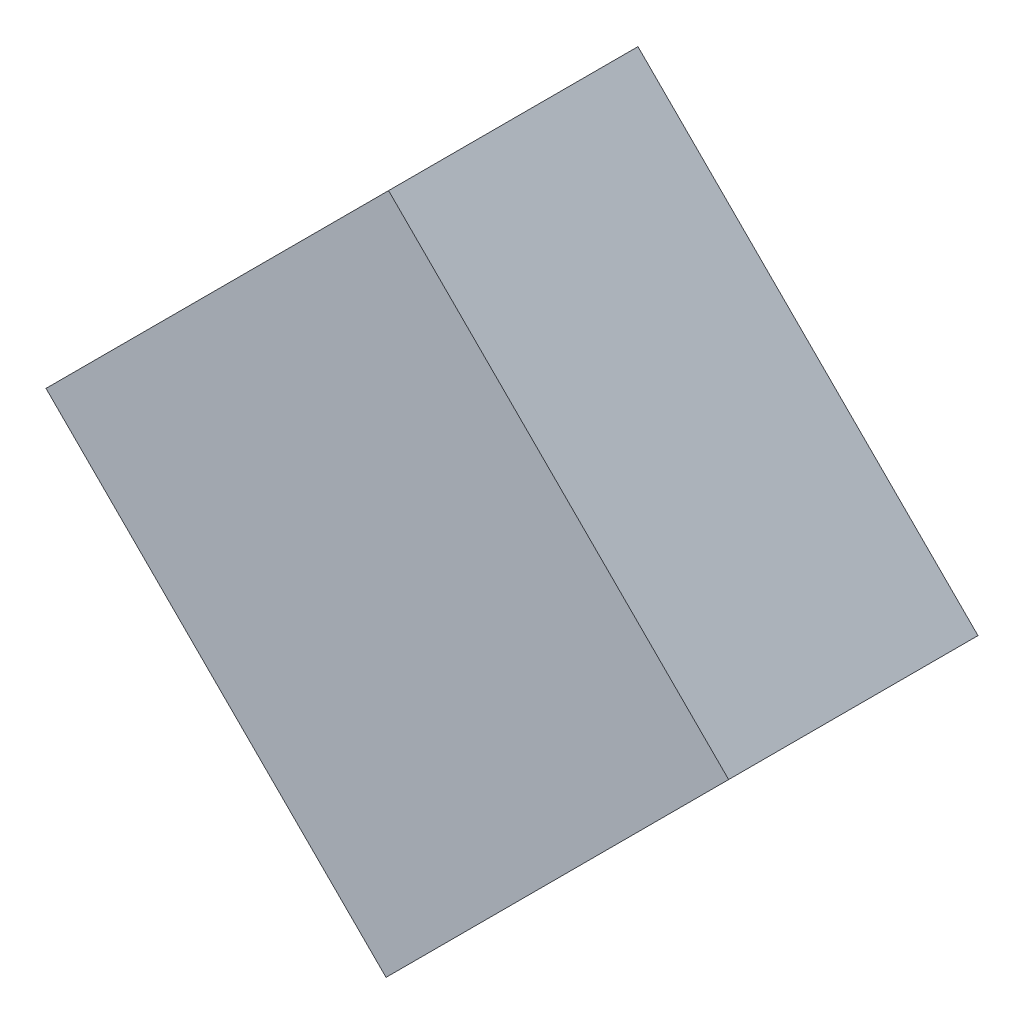
ISO-10303-21;
HEADER;
FILE_DESCRIPTION(('STEP AP214'),'2;1');
FILE_NAME('part.step','',(''),(''),'','','');
FILE_SCHEMA(('AUTOMOTIVE_DESIGN { 1 0 10303 214 1 1 1 1 }'));
ENDSEC;
DATA;
#1=APPLICATION_CONTEXT('core data for automotive mechanical design processes');
#2=APPLICATION_PROTOCOL_DEFINITION('international standard','automotive_design',2000,#1);
#3=PRODUCT_CONTEXT('',#1,'mechanical');
#4=PRODUCT('Part','Part','',(#3));
#5=PRODUCT_RELATED_PRODUCT_CATEGORY('part','',(#4));
#6=PRODUCT_DEFINITION_FORMATION('','',#4);
#7=PRODUCT_DEFINITION_CONTEXT('part definition',#1,'design');
#8=PRODUCT_DEFINITION('design','',#6,#7);
#9=PRODUCT_DEFINITION_SHAPE('','',#8);
#10=(LENGTH_UNIT() NAMED_UNIT(*) SI_UNIT(.MILLI.,.METRE.));
#11=(NAMED_UNIT(*) PLANE_ANGLE_UNIT() SI_UNIT($,.RADIAN.));
#12=(NAMED_UNIT(*) SI_UNIT($,.STERADIAN.) SOLID_ANGLE_UNIT());
#13=UNCERTAINTY_MEASURE_WITH_UNIT(LENGTH_MEASURE(1.E-05),#10,'distance_accuracy_value','');
#14=(GEOMETRIC_REPRESENTATION_CONTEXT(3) GLOBAL_UNCERTAINTY_ASSIGNED_CONTEXT((#13)) GLOBAL_UNIT_ASSIGNED_CONTEXT((#10,
#11,#12)) REPRESENTATION_CONTEXT('',''));
#15=CARTESIAN_POINT('',(0.,0.,0.));
#16=DIRECTION('',(0.,0.,1.));
#17=DIRECTION('',(1.,0.,0.));
#18=AXIS2_PLACEMENT_3D('',#15,#16,#17);
#19=CARTESIAN_POINT('',(0.003538219999996,0.95813118,0.));
#20=DIRECTION('',(0.707106781186548,0.707106781186548,0.));
#21=DIRECTION('',(0.707106781186548,-0.707106781186548,0.));
#22=AXIS2_PLACEMENT_3D('',#19,#20,#21);
#23=PLANE('',#22);
#24=DIRECTION('',(0.,0.,1.));
#25=VECTOR('',#24,1.);
#26=CARTESIAN_POINT('',(0.003538219999996,0.95813118,0.));
#27=LINE('',#26,#25);
#28=CARTESIAN_POINT('',(0.003538219999996,0.95813118,0.));
#29=VERTEX_POINT('',#28);
#30=CARTESIAN_POINT('',(0.003538219999996,0.95813118,0.70000114));
#31=VERTEX_POINT('',#30);
#32=EDGE_CURVE('E11',#29,#31,#27,.T.);
#33=ORIENTED_EDGE('',*,*,#32,.T.);
#34=DIRECTION('',(0.707106781186548,-0.707106781186548,0.));
#35=VECTOR('',#34,1.);
#36=CARTESIAN_POINT('',(0.003538219999996,0.95813118,0.70000114));
#37=LINE('',#36,#35);
#38=CARTESIAN_POINT('',(0.95813118,0.003538219999996,0.70000114));
#39=VERTEX_POINT('',#38);
#40=EDGE_CURVE('E24',#31,#39,#37,.T.);
#41=ORIENTED_EDGE('',*,*,#40,.T.);
#42=DIRECTION('',(0.,0.,1.));
#43=VECTOR('',#42,1.);
#44=CARTESIAN_POINT('',(0.95813118,0.003538219999996,0.));
#45=LINE('',#44,#43);
#46=CARTESIAN_POINT('',(0.95813118,0.003538219999996,0.));
#47=VERTEX_POINT('',#46);
#48=EDGE_CURVE('E85',#47,#39,#45,.T.);
#49=ORIENTED_EDGE('',*,*,#48,.F.);
#50=DIRECTION('',(0.707106781186548,-0.707106781186548,0.));
#51=VECTOR('',#50,1.);
#52=CARTESIAN_POINT('',(0.003538219999996,0.95813118,0.));
#53=LINE('',#52,#51);
#54=EDGE_CURVE('E83',#29,#47,#53,.T.);
#55=ORIENTED_EDGE('',*,*,#54,.F.);
#56=EDGE_LOOP('',(#33,#41,#49,#55));
#57=FACE_BOUND('',#56,.T.);
#58=ADVANCED_FACE('F17',(#57),#23,.T.);
#59=CARTESIAN_POINT('',(0.95813118,0.003538219999996,0.));
#60=DIRECTION('',(0.707106781186548,-0.707106781186548,0.));
#61=DIRECTION('',(-0.707106781186548,-0.707106781186548,0.));
#62=AXIS2_PLACEMENT_3D('',#59,#60,#61);
#63=PLANE('',#62);
#64=ORIENTED_EDGE('',*,*,#48,.T.);
#65=DIRECTION('',(-0.707106781186548,-0.707106781186548,0.));
#66=VECTOR('',#65,1.);
#67=CARTESIAN_POINT('',(0.95813118,0.003538219999996,0.70000114));
#68=LINE('',#67,#66);
#69=CARTESIAN_POINT('',(-0.003535679999999,-0.95812864,0.70000114));
#70=VERTEX_POINT('',#69);
#71=EDGE_CURVE('E81',#39,#70,#68,.T.);
#72=ORIENTED_EDGE('',*,*,#71,.T.);
#73=DIRECTION('',(0.,0.,1.));
#74=VECTOR('',#73,1.);
#75=CARTESIAN_POINT('',(-0.003535679999999,-0.95812864,0.));
#76=LINE('',#75,#74);
#77=CARTESIAN_POINT('',(-0.003535679999999,-0.95812864,0.));
#78=VERTEX_POINT('',#77);
#79=EDGE_CURVE('E79',#78,#70,#76,.T.);
#80=ORIENTED_EDGE('',*,*,#79,.F.);
#81=DIRECTION('',(-0.707106781186548,-0.707106781186548,0.));
#82=VECTOR('',#81,1.);
#83=CARTESIAN_POINT('',(0.95813118,0.003538219999996,0.));
#84=LINE('',#83,#82);
#85=EDGE_CURVE('E70',#47,#78,#84,.T.);
#86=ORIENTED_EDGE('',*,*,#85,.F.);
#87=EDGE_LOOP('',(#64,#72,#80,#86));
#88=FACE_BOUND('',#87,.T.);
#89=ADVANCED_FACE('F90',(#88),#63,.T.);
#90=CARTESIAN_POINT('',(-0.003535679999999,-0.95812864,0.));
#91=DIRECTION('',(-0.707106781186548,-0.707106781186548,0.));
#92=DIRECTION('',(-0.707106781186548,0.707106781186548,0.));
#93=AXIS2_PLACEMENT_3D('',#90,#91,#92);
#94=PLANE('',#93);
#95=ORIENTED_EDGE('',*,*,#79,.T.);
#96=DIRECTION('',(-0.707106781186548,0.707106781186548,0.));
#97=VECTOR('',#96,1.);
#98=CARTESIAN_POINT('',(-0.003535679999999,-0.95812864,0.70000114));
#99=LINE('',#98,#97);
#100=CARTESIAN_POINT('',(-0.95812864,-0.003535680000013,0.70000114));
#101=VERTEX_POINT('',#100);
#102=EDGE_CURVE('E60',#70,#101,#99,.T.);
#103=ORIENTED_EDGE('',*,*,#102,.T.);
#104=DIRECTION('',(0.,0.,1.));
#105=VECTOR('',#104,1.);
#106=CARTESIAN_POINT('',(-0.95812864,-0.003535680000013,0.));
#107=LINE('',#106,#105);
#108=CARTESIAN_POINT('',(-0.95812864,-0.003535680000013,0.));
#109=VERTEX_POINT('',#108);
#110=EDGE_CURVE('E54',#109,#101,#107,.T.);
#111=ORIENTED_EDGE('',*,*,#110,.F.);
#112=DIRECTION('',(-0.707106781186548,0.707106781186548,0.));
#113=VECTOR('',#112,1.);
#114=CARTESIAN_POINT('',(-0.003535679999999,-0.95812864,0.));
#115=LINE('',#114,#113);
#116=EDGE_CURVE('E58',#78,#109,#115,.T.);
#117=ORIENTED_EDGE('',*,*,#116,.F.);
#118=EDGE_LOOP('',(#95,#103,#111,#117));
#119=FACE_BOUND('',#118,.T.);
#120=ADVANCED_FACE('F57',(#119),#94,.T.);
#121=CARTESIAN_POINT('',(-0.95812864,-0.003535680000013,0.));
#122=DIRECTION('',(-0.707106781186548,0.707106781186548,0.));
#123=DIRECTION('',(0.707106781186548,0.707106781186548,0.));
#124=AXIS2_PLACEMENT_3D('',#121,#122,#123);
#125=PLANE('',#124);
#126=ORIENTED_EDGE('',*,*,#110,.T.);
#127=DIRECTION('',(0.707106781186548,0.707106781186548,0.));
#128=VECTOR('',#127,1.);
#129=CARTESIAN_POINT('',(-0.95812864,-0.003535680000013,0.70000114));
#130=LINE('',#129,#128);
#131=EDGE_CURVE('E71',#101,#31,#130,.T.);
#132=ORIENTED_EDGE('',*,*,#131,.T.);
#133=ORIENTED_EDGE('',*,*,#32,.F.);
#134=DIRECTION('',(0.707106781186548,0.707106781186548,0.));
#135=VECTOR('',#134,1.);
#136=CARTESIAN_POINT('',(-0.95812864,-0.003535680000013,0.));
#137=LINE('',#136,#135);
#138=EDGE_CURVE('E68',#109,#29,#137,.T.);
#139=ORIENTED_EDGE('',*,*,#138,.F.);
#140=EDGE_LOOP('',(#126,#132,#133,#139));
#141=FACE_BOUND('',#140,.T.);
#142=ADVANCED_FACE('F73',(#141),#125,.T.);
#143=CARTESIAN_POINT('',(0.003538219999996,0.95813118,0.));
#144=DIRECTION('',(0.,0.,1.));
#145=DIRECTION('',(1.,0.,0.));
#146=AXIS2_PLACEMENT_3D('',#143,#144,#145);
#147=PLANE('',#146);
#148=ORIENTED_EDGE('',*,*,#54,.T.);
#149=ORIENTED_EDGE('',*,*,#85,.T.);
#150=ORIENTED_EDGE('',*,*,#116,.T.);
#151=ORIENTED_EDGE('',*,*,#138,.T.);
#152=EDGE_LOOP('',(#148,#149,#150,#151));
#153=FACE_BOUND('',#152,.T.);
#154=ADVANCED_FACE('F67',(#153),#147,.F.);
#155=CARTESIAN_POINT('',(0.003538219999996,0.95813118,0.70000114));
#156=DIRECTION('',(0.,0.,1.));
#157=DIRECTION('',(1.,0.,0.));
#158=AXIS2_PLACEMENT_3D('',#155,#156,#157);
#159=PLANE('',#158);
#160=ORIENTED_EDGE('',*,*,#131,.F.);
#161=ORIENTED_EDGE('',*,*,#102,.F.);
#162=ORIENTED_EDGE('',*,*,#71,.F.);
#163=ORIENTED_EDGE('',*,*,#40,.F.);
#164=EDGE_LOOP('',(#160,#161,#162,#163));
#165=FACE_BOUND('',#164,.T.);
#166=ADVANCED_FACE('F91',(#165),#159,.T.);
#167=CLOSED_SHELL('',(#58,#89,#120,#142,#154,#166));
#168=MANIFOLD_SOLID_BREP('B1',#167);
#169=ADVANCED_BREP_SHAPE_REPRESENTATION('',(#18,#168),#14);
#170=SHAPE_DEFINITION_REPRESENTATION(#9,#169);
ENDSEC;
END-ISO-10303-21;
